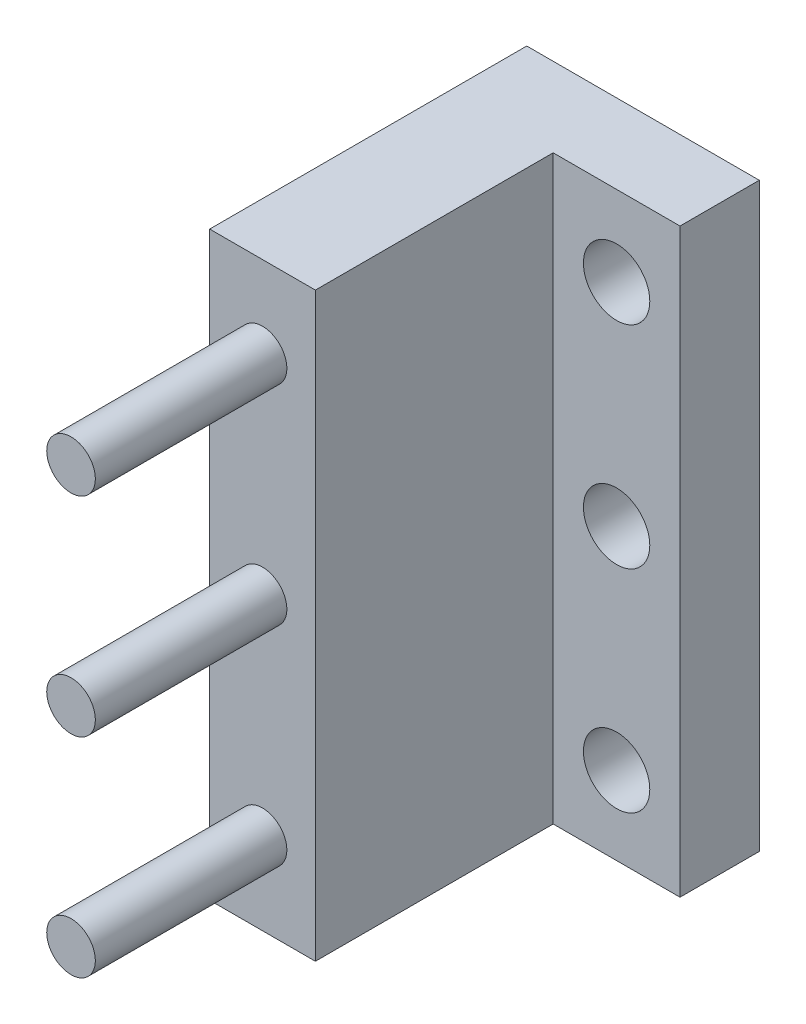
ISO-10303-21;
HEADER;
FILE_DESCRIPTION(('STEP AP214'),'2;1');
FILE_NAME('part.step','',(''),(''),'','','');
FILE_SCHEMA(('AUTOMOTIVE_DESIGN { 1 0 10303 214 1 1 1 1 }'));
ENDSEC;
DATA;
#1=APPLICATION_CONTEXT('core data for automotive mechanical design processes');
#2=APPLICATION_PROTOCOL_DEFINITION('international standard','automotive_design',2000,#1);
#3=PRODUCT_CONTEXT('',#1,'mechanical');
#4=PRODUCT('Part','Part','',(#3));
#5=PRODUCT_RELATED_PRODUCT_CATEGORY('part','',(#4));
#6=PRODUCT_DEFINITION_FORMATION('','',#4);
#7=PRODUCT_DEFINITION_CONTEXT('part definition',#1,'design');
#8=PRODUCT_DEFINITION('design','',#6,#7);
#9=PRODUCT_DEFINITION_SHAPE('','',#8);
#10=(LENGTH_UNIT() NAMED_UNIT(*) SI_UNIT(.MILLI.,.METRE.));
#11=(NAMED_UNIT(*) PLANE_ANGLE_UNIT() SI_UNIT($,.RADIAN.));
#12=(NAMED_UNIT(*) SI_UNIT($,.STERADIAN.) SOLID_ANGLE_UNIT());
#13=UNCERTAINTY_MEASURE_WITH_UNIT(LENGTH_MEASURE(1.E-05),#10,'distance_accuracy_value','');
#14=(GEOMETRIC_REPRESENTATION_CONTEXT(3) GLOBAL_UNCERTAINTY_ASSIGNED_CONTEXT((#13)) GLOBAL_UNIT_ASSIGNED_CONTEXT((#10,
#11,#12)) REPRESENTATION_CONTEXT('',''));
#15=CARTESIAN_POINT('',(0.,0.,0.));
#16=DIRECTION('',(0.,0.,1.));
#17=DIRECTION('',(1.,0.,0.));
#18=AXIS2_PLACEMENT_3D('',#15,#16,#17);
#19=CARTESIAN_POINT('',(-187.959999937843,125.470053269357,30.1625));
#20=DIRECTION('',(1.,0.,0.));
#21=DIRECTION('',(0.,0.,-1.));
#22=AXIS2_PLACEMENT_3D('',#19,#20,#21);
#23=PLANE('',#22);
#24=DIRECTION('',(0.,-1.,0.));
#25=VECTOR('',#24,1.);
#26=CARTESIAN_POINT('',(-187.959999937843,125.470053269357,25.4));
#27=LINE('',#26,#25);
#28=CARTESIAN_POINT('',(-187.959999937843,125.470053269357,25.4));
#29=VERTEX_POINT('',#28);
#30=CARTESIAN_POINT('',(-187.959999937843,90.5450532693566,25.4));
#31=VERTEX_POINT('',#30);
#32=EDGE_CURVE('E93',#29,#31,#27,.T.);
#33=ORIENTED_EDGE('',*,*,#32,.T.);
#34=DIRECTION('',(0.,0.,-1.));
#35=VECTOR('',#34,1.);
#36=CARTESIAN_POINT('',(-187.959999937843,90.5450532693566,30.1625));
#37=LINE('',#36,#35);
#38=CARTESIAN_POINT('',(-187.959999937843,90.5450532693566,44.45));
#39=VERTEX_POINT('',#38);
#40=EDGE_CURVE('E115',#39,#31,#37,.T.);
#41=ORIENTED_EDGE('',*,*,#40,.F.);
#42=DIRECTION('',(0.,-1.,0.));
#43=VECTOR('',#42,1.);
#44=CARTESIAN_POINT('',(-187.959999937843,90.5450532693566,44.45));
#45=LINE('',#44,#43);
#46=CARTESIAN_POINT('',(-187.959999937843,125.470053269357,44.45));
#47=VERTEX_POINT('',#46);
#48=EDGE_CURVE('E95',#47,#39,#45,.T.);
#49=ORIENTED_EDGE('',*,*,#48,.F.);
#50=DIRECTION('',(0.,0.,-1.));
#51=VECTOR('',#50,1.);
#52=CARTESIAN_POINT('',(-187.959999937843,125.470053269357,30.1625));
#53=LINE('',#52,#51);
#54=EDGE_CURVE('E79',#47,#29,#53,.T.);
#55=ORIENTED_EDGE('',*,*,#54,.T.);
#56=EDGE_LOOP('',(#33,#41,#49,#55));
#57=FACE_BOUND('',#56,.T.);
#58=ADVANCED_FACE('F33',(#57),#23,.F.);
#59=CARTESIAN_POINT('',(-187.959999937843,90.5450532693566,30.1625));
#60=DIRECTION('',(0.,1.,0.));
#61=DIRECTION('',(-1.,0.,0.));
#62=AXIS2_PLACEMENT_3D('',#59,#60,#61);
#63=PLANE('',#62);
#64=DIRECTION('',(1.,0.,0.));
#65=VECTOR('',#64,1.);
#66=CARTESIAN_POINT('',(-187.959999937843,90.5450532693566,25.4));
#67=LINE('',#66,#65);
#68=CARTESIAN_POINT('',(-173.989999937843,90.5450532693565,25.4));
#69=VERTEX_POINT('',#68);
#70=EDGE_CURVE('E99',#31,#69,#67,.T.);
#71=ORIENTED_EDGE('',*,*,#70,.T.);
#72=DIRECTION('',(0.,0.,-1.));
#73=VECTOR('',#72,1.);
#74=CARTESIAN_POINT('',(-173.989999937843,90.5450532693565,30.1625));
#75=LINE('',#74,#73);
#76=CARTESIAN_POINT('',(-173.989999937843,90.5450532693565,30.1625));
#77=VERTEX_POINT('',#76);
#78=EDGE_CURVE('E112',#77,#69,#75,.T.);
#79=ORIENTED_EDGE('',*,*,#78,.F.);
#80=DIRECTION('',(1.,0.,0.));
#81=VECTOR('',#80,1.);
#82=CARTESIAN_POINT('',(-187.959999937843,90.5450532693566,30.1625));
#83=LINE('',#82,#81);
#84=CARTESIAN_POINT('',(-181.609999937843,90.5450532693566,30.1625));
#85=VERTEX_POINT('',#84);
#86=EDGE_CURVE('E86',#85,#77,#83,.T.);
#87=ORIENTED_EDGE('',*,*,#86,.F.);
#88=DIRECTION('',(0.,0.,-1.));
#89=VECTOR('',#88,1.);
#90=CARTESIAN_POINT('',(-181.609999937843,90.5450532693566,44.45));
#91=LINE('',#90,#89);
#92=CARTESIAN_POINT('',(-181.609999937843,90.5450532693566,44.45));
#93=VERTEX_POINT('',#92);
#94=EDGE_CURVE('E101',#93,#85,#91,.T.);
#95=ORIENTED_EDGE('',*,*,#94,.F.);
#96=DIRECTION('',(1.,0.,0.));
#97=VECTOR('',#96,1.);
#98=CARTESIAN_POINT('',(-187.959999937843,90.5450532693566,44.45));
#99=LINE('',#98,#97);
#100=EDGE_CURVE('E148',#39,#93,#99,.T.);
#101=ORIENTED_EDGE('',*,*,#100,.F.);
#102=ORIENTED_EDGE('',*,*,#40,.T.);
#103=EDGE_LOOP('',(#71,#79,#87,#95,#101,#102));
#104=FACE_BOUND('',#103,.T.);
#105=ADVANCED_FACE('F177',(#104),#63,.F.);
#106=CARTESIAN_POINT('',(-173.989999937843,125.470053269357,30.1625));
#107=DIRECTION('',(-1.,0.,0.));
#108=DIRECTION('',(0.,-1.,0.));
#109=AXIS2_PLACEMENT_3D('',#106,#107,#108);
#110=PLANE('',#109);
#111=DIRECTION('',(0.,1.,0.));
#112=VECTOR('',#111,1.);
#113=CARTESIAN_POINT('',(-173.989999937843,125.470053269357,25.4));
#114=LINE('',#113,#112);
#115=CARTESIAN_POINT('',(-173.989999937843,125.470053269357,25.4));
#116=VERTEX_POINT('',#115);
#117=EDGE_CURVE('E87',#69,#116,#114,.T.);
#118=ORIENTED_EDGE('',*,*,#117,.T.);
#119=DIRECTION('',(0.,0.,-1.));
#120=VECTOR('',#119,1.);
#121=CARTESIAN_POINT('',(-173.989999937843,125.470053269357,30.1625));
#122=LINE('',#121,#120);
#123=CARTESIAN_POINT('',(-173.989999937843,125.470053269357,30.1625));
#124=VERTEX_POINT('',#123);
#125=EDGE_CURVE('E82',#124,#116,#122,.T.);
#126=ORIENTED_EDGE('',*,*,#125,.F.);
#127=DIRECTION('',(0.,1.,0.));
#128=VECTOR('',#127,1.);
#129=CARTESIAN_POINT('',(-173.989999937843,125.470053269357,30.1625));
#130=LINE('',#129,#128);
#131=EDGE_CURVE('E55',#77,#124,#130,.T.);
#132=ORIENTED_EDGE('',*,*,#131,.F.);
#133=ORIENTED_EDGE('',*,*,#78,.T.);
#134=EDGE_LOOP('',(#118,#126,#132,#133));
#135=FACE_BOUND('',#134,.T.);
#136=ADVANCED_FACE('F180',(#135),#110,.F.);
#137=CARTESIAN_POINT('',(-187.959999937843,125.470053269357,30.1625));
#138=DIRECTION('',(0.,-1.,0.));
#139=DIRECTION('',(1.,0.,0.));
#140=AXIS2_PLACEMENT_3D('',#137,#138,#139);
#141=PLANE('',#140);
#142=DIRECTION('',(-1.,0.,0.));
#143=VECTOR('',#142,1.);
#144=CARTESIAN_POINT('',(-187.959999937843,125.470053269357,25.4));
#145=LINE('',#144,#143);
#146=EDGE_CURVE('E75',#116,#29,#145,.T.);
#147=ORIENTED_EDGE('',*,*,#146,.T.);
#148=ORIENTED_EDGE('',*,*,#54,.F.);
#149=DIRECTION('',(-1.,0.,0.));
#150=VECTOR('',#149,1.);
#151=CARTESIAN_POINT('',(-187.959999937843,125.470053269357,44.45));
#152=LINE('',#151,#150);
#153=CARTESIAN_POINT('',(-181.609999937843,125.470053269357,44.45));
#154=VERTEX_POINT('',#153);
#155=EDGE_CURVE('E154',#154,#47,#152,.T.);
#156=ORIENTED_EDGE('',*,*,#155,.F.);
#157=DIRECTION('',(0.,0.,-1.));
#158=VECTOR('',#157,1.);
#159=CARTESIAN_POINT('',(-181.609999937843,125.470053269357,44.45));
#160=LINE('',#159,#158);
#161=CARTESIAN_POINT('',(-181.609999937843,125.470053269357,30.1625));
#162=VERTEX_POINT('',#161);
#163=EDGE_CURVE('E105',#154,#162,#160,.T.);
#164=ORIENTED_EDGE('',*,*,#163,.T.);
#165=DIRECTION('',(-1.,0.,0.));
#166=VECTOR('',#165,1.);
#167=CARTESIAN_POINT('',(-187.959999937843,125.470053269357,30.1625));
#168=LINE('',#167,#166);
#169=EDGE_CURVE('E96',#124,#162,#168,.T.);
#170=ORIENTED_EDGE('',*,*,#169,.F.);
#171=ORIENTED_EDGE('',*,*,#125,.T.);
#172=EDGE_LOOP('',(#147,#148,#156,#164,#170,#171));
#173=FACE_BOUND('',#172,.T.);
#174=ADVANCED_FACE('F77',(#173),#141,.F.);
#175=CARTESIAN_POINT('',(0.,0.,30.1625));
#176=DIRECTION('',(0.,0.,1.));
#177=DIRECTION('',(1.,0.,0.));
#178=AXIS2_PLACEMENT_3D('',#175,#176,#177);
#179=PLANE('',#178);
#180=CARTESIAN_POINT('',(-177.799999937845,95.2440532693565,30.1625));
#181=DIRECTION('',(0.,0.,1.));
#182=DIRECTION('',(1.,0.,0.));
#183=AXIS2_PLACEMENT_3D('',#180,#181,#182);
#184=CIRCLE('',#183,1.99389999999994);
#185=CARTESIAN_POINT('',(-175.806099937845,95.2440532693565,30.1625));
#186=VERTEX_POINT('',#185);
#187=EDGE_CURVE('E125',#186,#186,#184,.T.);
#188=ORIENTED_EDGE('',*,*,#187,.F.);
#189=EDGE_LOOP('',(#188));
#190=FACE_BOUND('',#189,.T.);
#191=CARTESIAN_POINT('',(-177.799999937845,107.944053269357,30.1625));
#192=DIRECTION('',(0.,0.,1.));
#193=DIRECTION('',(1.,0.,0.));
#194=AXIS2_PLACEMENT_3D('',#191,#192,#193);
#195=CIRCLE('',#194,1.99389999999994);
#196=CARTESIAN_POINT('',(-175.806099937845,107.944053269357,30.1625));
#197=VERTEX_POINT('',#196);
#198=EDGE_CURVE('E333',#197,#197,#195,.T.);
#199=ORIENTED_EDGE('',*,*,#198,.F.);
#200=EDGE_LOOP('',(#199));
#201=FACE_BOUND('',#200,.T.);
#202=CARTESIAN_POINT('',(-177.799999937845,120.644053269357,30.1625));
#203=DIRECTION('',(0.,0.,1.));
#204=DIRECTION('',(1.,0.,0.));
#205=AXIS2_PLACEMENT_3D('',#202,#203,#204);
#206=CIRCLE('',#205,1.99389999999997);
#207=CARTESIAN_POINT('',(-175.806099937845,120.644053269357,30.1625));
#208=VERTEX_POINT('',#207);
#209=EDGE_CURVE('E142',#208,#208,#206,.T.);
#210=ORIENTED_EDGE('',*,*,#209,.F.);
#211=EDGE_LOOP('',(#210));
#212=FACE_BOUND('',#211,.T.);
#213=DIRECTION('',(0.,1.,0.));
#214=VECTOR('',#213,1.);
#215=CARTESIAN_POINT('',(-181.609999937843,90.5450532693566,30.1625));
#216=LINE('',#215,#214);
#217=EDGE_CURVE('E49',#85,#162,#216,.T.);
#218=ORIENTED_EDGE('',*,*,#217,.F.);
#219=ORIENTED_EDGE('',*,*,#86,.T.);
#220=ORIENTED_EDGE('',*,*,#131,.T.);
#221=ORIENTED_EDGE('',*,*,#169,.T.);
#222=EDGE_LOOP('',(#218,#219,#220,#221));
#223=FACE_BOUND('',#222,.T.);
#224=ADVANCED_FACE('F160',(#190,#201,#212,#223),#179,.T.);
#225=CARTESIAN_POINT('',(0.,0.,25.4));
#226=DIRECTION('',(0.,0.,1.));
#227=DIRECTION('',(1.,0.,0.));
#228=AXIS2_PLACEMENT_3D('',#225,#226,#227);
#229=PLANE('',#228);
#230=CARTESIAN_POINT('',(-177.799999937845,95.2440532693565,25.4));
#231=DIRECTION('',(0.,0.,1.));
#232=DIRECTION('',(1.,0.,0.));
#233=AXIS2_PLACEMENT_3D('',#230,#231,#232);
#234=CIRCLE('',#233,1.99389999999994);
#235=CARTESIAN_POINT('',(-175.806099937845,95.2440532693565,25.4));
#236=VERTEX_POINT('',#235);
#237=EDGE_CURVE('E36',#236,#236,#234,.T.);
#238=ORIENTED_EDGE('',*,*,#237,.T.);
#239=EDGE_LOOP('',(#238));
#240=FACE_BOUND('',#239,.T.);
#241=CARTESIAN_POINT('',(-177.799999937845,107.944053269357,25.4));
#242=DIRECTION('',(0.,0.,1.));
#243=DIRECTION('',(1.,0.,0.));
#244=AXIS2_PLACEMENT_3D('',#241,#242,#243);
#245=CIRCLE('',#244,1.99389999999994);
#246=CARTESIAN_POINT('',(-175.806099937845,107.944053269357,25.4));
#247=VERTEX_POINT('',#246);
#248=EDGE_CURVE('E124',#247,#247,#245,.T.);
#249=ORIENTED_EDGE('',*,*,#248,.T.);
#250=EDGE_LOOP('',(#249));
#251=FACE_BOUND('',#250,.T.);
#252=CARTESIAN_POINT('',(-177.799999937845,120.644053269357,25.4));
#253=DIRECTION('',(0.,0.,1.));
#254=DIRECTION('',(1.,0.,0.));
#255=AXIS2_PLACEMENT_3D('',#252,#253,#254);
#256=CIRCLE('',#255,1.99389999999997);
#257=CARTESIAN_POINT('',(-175.806099937845,120.644053269357,25.4));
#258=VERTEX_POINT('',#257);
#259=EDGE_CURVE('E122',#258,#258,#256,.T.);
#260=ORIENTED_EDGE('',*,*,#259,.T.);
#261=EDGE_LOOP('',(#260));
#262=FACE_BOUND('',#261,.T.);
#263=ORIENTED_EDGE('',*,*,#32,.F.);
#264=ORIENTED_EDGE('',*,*,#146,.F.);
#265=ORIENTED_EDGE('',*,*,#117,.F.);
#266=ORIENTED_EDGE('',*,*,#70,.F.);
#267=EDGE_LOOP('',(#263,#264,#265,#266));
#268=FACE_BOUND('',#267,.T.);
#269=ADVANCED_FACE('F98',(#240,#251,#262,#268),#229,.F.);
#270=CARTESIAN_POINT('',(-181.609999937843,90.5450532693566,44.45));
#271=DIRECTION('',(-1.,0.,0.));
#272=DIRECTION('',(0.,0.,1.));
#273=AXIS2_PLACEMENT_3D('',#270,#271,#272);
#274=PLANE('',#273);
#275=ORIENTED_EDGE('',*,*,#217,.T.);
#276=ORIENTED_EDGE('',*,*,#163,.F.);
#277=DIRECTION('',(0.,1.,0.));
#278=VECTOR('',#277,1.);
#279=CARTESIAN_POINT('',(-181.609999937843,90.5450532693566,44.45));
#280=LINE('',#279,#278);
#281=EDGE_CURVE('E151',#93,#154,#280,.T.);
#282=ORIENTED_EDGE('',*,*,#281,.F.);
#283=ORIENTED_EDGE('',*,*,#94,.T.);
#284=EDGE_LOOP('',(#275,#276,#282,#283));
#285=FACE_BOUND('',#284,.T.);
#286=ADVANCED_FACE('F164',(#285),#274,.F.);
#287=CARTESIAN_POINT('',(0.,0.,44.45));
#288=DIRECTION('',(0.,0.,-1.));
#289=DIRECTION('',(-1.,0.,0.));
#290=AXIS2_PLACEMENT_3D('',#287,#288,#289);
#291=PLANE('',#290);
#292=CARTESIAN_POINT('',(-184.784999937843,95.4739740693566,44.45));
#293=DIRECTION('',(0.,0.,-1.));
#294=DIRECTION('',(-1.,0.,0.));
#295=AXIS2_PLACEMENT_3D('',#292,#293,#294);
#296=CIRCLE('',#295,1.4605);
#297=CARTESIAN_POINT('',(-186.245499937843,95.4739740693566,44.45));
#298=VERTEX_POINT('',#297);
#299=EDGE_CURVE('E11',#298,#298,#296,.F.);
#300=ORIENTED_EDGE('',*,*,#299,.F.);
#301=EDGE_LOOP('',(#300));
#302=FACE_BOUND('',#301,.T.);
#303=CARTESIAN_POINT('',(-184.784999937843,108.007553269357,44.45));
#304=DIRECTION('',(0.,0.,-1.));
#305=DIRECTION('',(-1.,0.,0.));
#306=AXIS2_PLACEMENT_3D('',#303,#304,#305);
#307=CIRCLE('',#306,1.4605);
#308=CARTESIAN_POINT('',(-186.245499937843,108.007553269357,44.45));
#309=VERTEX_POINT('',#308);
#310=EDGE_CURVE('E41',#309,#309,#307,.F.);
#311=ORIENTED_EDGE('',*,*,#310,.F.);
#312=EDGE_LOOP('',(#311));
#313=FACE_BOUND('',#312,.T.);
#314=CARTESIAN_POINT('',(-184.784999937843,120.541132469357,44.45));
#315=DIRECTION('',(0.,0.,-1.));
#316=DIRECTION('',(-1.,0.,0.));
#317=AXIS2_PLACEMENT_3D('',#314,#315,#316);
#318=CIRCLE('',#317,1.4605);
#319=CARTESIAN_POINT('',(-186.245499937843,120.541132469357,44.45));
#320=VERTEX_POINT('',#319);
#321=EDGE_CURVE('E117',#320,#320,#318,.F.);
#322=ORIENTED_EDGE('',*,*,#321,.F.);
#323=EDGE_LOOP('',(#322));
#324=FACE_BOUND('',#323,.T.);
#325=ORIENTED_EDGE('',*,*,#48,.T.);
#326=ORIENTED_EDGE('',*,*,#100,.T.);
#327=ORIENTED_EDGE('',*,*,#281,.T.);
#328=ORIENTED_EDGE('',*,*,#155,.T.);
#329=EDGE_LOOP('',(#325,#326,#327,#328));
#330=FACE_BOUND('',#329,.T.);
#331=ADVANCED_FACE('F171',(#302,#313,#324,#330),#291,.F.);
#332=CARTESIAN_POINT('',(-184.784999937843,120.541132469357,55.9562));
#333=DIRECTION('',(0.,0.,-1.));
#334=DIRECTION('',(-1.,0.,0.));
#335=AXIS2_PLACEMENT_3D('',#332,#333,#334);
#336=CYLINDRICAL_SURFACE('',#335,1.4605);
#337=CARTESIAN_POINT('',(-184.784999937843,120.541132469357,55.9562));
#338=DIRECTION('',(0.,0.,1.));
#339=DIRECTION('',(1.,0.,0.));
#340=AXIS2_PLACEMENT_3D('',#337,#338,#339);
#341=CIRCLE('',#340,1.4605);
#342=CARTESIAN_POINT('',(-183.324499937843,120.541132469357,55.9562));
#343=VERTEX_POINT('',#342);
#344=EDGE_CURVE('E139',#343,#343,#341,.T.);
#345=ORIENTED_EDGE('',*,*,#344,.F.);
#346=EDGE_LOOP('',(#345));
#347=FACE_BOUND('',#346,.T.);
#348=ORIENTED_EDGE('',*,*,#321,.T.);
#349=EDGE_LOOP('',(#348));
#350=FACE_BOUND('',#349,.T.);
#351=ADVANCED_FACE('F222',(#347,#350),#336,.T.);
#352=CARTESIAN_POINT('',(-184.784999937843,120.541132469357,55.9562));
#353=DIRECTION('',(0.,0.,1.));
#354=DIRECTION('',(1.,0.,0.));
#355=AXIS2_PLACEMENT_3D('',#352,#353,#354);
#356=PLANE('',#355);
#357=ORIENTED_EDGE('',*,*,#344,.T.);
#358=EDGE_LOOP('',(#357));
#359=FACE_BOUND('',#358,.T.);
#360=ADVANCED_FACE('F232',(#359),#356,.T.);
#361=CARTESIAN_POINT('',(-184.784999937843,108.007553269357,55.9562));
#362=DIRECTION('',(0.,0.,-1.));
#363=DIRECTION('',(-1.,0.,0.));
#364=AXIS2_PLACEMENT_3D('',#361,#362,#363);
#365=CYLINDRICAL_SURFACE('',#364,1.4605);
#366=CARTESIAN_POINT('',(-184.784999937843,108.007553269357,55.9562));
#367=DIRECTION('',(0.,0.,1.));
#368=DIRECTION('',(1.,0.,0.));
#369=AXIS2_PLACEMENT_3D('',#366,#367,#368);
#370=CIRCLE('',#369,1.4605);
#371=CARTESIAN_POINT('',(-183.324499937843,108.007553269357,55.9562));
#372=VERTEX_POINT('',#371);
#373=EDGE_CURVE('E134',#372,#372,#370,.T.);
#374=ORIENTED_EDGE('',*,*,#373,.F.);
#375=EDGE_LOOP('',(#374));
#376=FACE_BOUND('',#375,.T.);
#377=ORIENTED_EDGE('',*,*,#310,.T.);
#378=EDGE_LOOP('',(#377));
#379=FACE_BOUND('',#378,.T.);
#380=ADVANCED_FACE('F242',(#376,#379),#365,.T.);
#381=CARTESIAN_POINT('',(-184.784999937843,108.007553269357,55.9562));
#382=DIRECTION('',(0.,0.,1.));
#383=DIRECTION('',(1.,0.,0.));
#384=AXIS2_PLACEMENT_3D('',#381,#382,#383);
#385=PLANE('',#384);
#386=ORIENTED_EDGE('',*,*,#373,.T.);
#387=EDGE_LOOP('',(#386));
#388=FACE_BOUND('',#387,.T.);
#389=ADVANCED_FACE('F252',(#388),#385,.T.);
#390=CARTESIAN_POINT('',(-184.784999937843,95.4739740693566,55.9562));
#391=DIRECTION('',(0.,0.,-1.));
#392=DIRECTION('',(-1.,0.,0.));
#393=AXIS2_PLACEMENT_3D('',#390,#391,#392);
#394=CYLINDRICAL_SURFACE('',#393,1.4605);
#395=CARTESIAN_POINT('',(-184.784999937843,95.4739740693566,55.9562));
#396=DIRECTION('',(0.,0.,1.));
#397=DIRECTION('',(1.,0.,0.));
#398=AXIS2_PLACEMENT_3D('',#395,#396,#397);
#399=CIRCLE('',#398,1.4605);
#400=CARTESIAN_POINT('',(-183.324499937843,95.4739740693566,55.9562));
#401=VERTEX_POINT('',#400);
#402=EDGE_CURVE('E130',#401,#401,#399,.T.);
#403=ORIENTED_EDGE('',*,*,#402,.F.);
#404=EDGE_LOOP('',(#403));
#405=FACE_BOUND('',#404,.T.);
#406=ORIENTED_EDGE('',*,*,#299,.T.);
#407=EDGE_LOOP('',(#406));
#408=FACE_BOUND('',#407,.T.);
#409=ADVANCED_FACE('F262',(#405,#408),#394,.T.);
#410=CARTESIAN_POINT('',(-184.784999937843,95.4739740693566,55.9562));
#411=DIRECTION('',(0.,0.,1.));
#412=DIRECTION('',(1.,0.,0.));
#413=AXIS2_PLACEMENT_3D('',#410,#411,#412);
#414=PLANE('',#413);
#415=ORIENTED_EDGE('',*,*,#402,.T.);
#416=EDGE_LOOP('',(#415));
#417=FACE_BOUND('',#416,.T.);
#418=ADVANCED_FACE('F272',(#417),#414,.T.);
#419=CARTESIAN_POINT('',(-177.799999937845,120.644053269357,18.6563));
#420=DIRECTION('',(0.,0.,1.));
#421=DIRECTION('',(1.,0.,0.));
#422=AXIS2_PLACEMENT_3D('',#419,#420,#421);
#423=CYLINDRICAL_SURFACE('',#422,1.99389999999997);
#424=ORIENTED_EDGE('',*,*,#209,.T.);
#425=EDGE_LOOP('',(#424));
#426=FACE_BOUND('',#425,.T.);
#427=ORIENTED_EDGE('',*,*,#259,.F.);
#428=EDGE_LOOP('',(#427));
#429=FACE_BOUND('',#428,.T.);
#430=ADVANCED_FACE('F282',(#426,#429),#423,.F.);
#431=CARTESIAN_POINT('',(-177.799999937845,107.944053269357,18.6563));
#432=DIRECTION('',(0.,0.,1.));
#433=DIRECTION('',(1.,0.,0.));
#434=AXIS2_PLACEMENT_3D('',#431,#432,#433);
#435=CYLINDRICAL_SURFACE('',#434,1.99389999999994);
#436=ORIENTED_EDGE('',*,*,#198,.T.);
#437=EDGE_LOOP('',(#436));
#438=FACE_BOUND('',#437,.T.);
#439=ORIENTED_EDGE('',*,*,#248,.F.);
#440=EDGE_LOOP('',(#439));
#441=FACE_BOUND('',#440,.T.);
#442=ADVANCED_FACE('F306',(#438,#441),#435,.F.);
#443=CARTESIAN_POINT('',(-177.799999937845,95.2440532693565,18.6563));
#444=DIRECTION('',(0.,0.,1.));
#445=DIRECTION('',(1.,0.,0.));
#446=AXIS2_PLACEMENT_3D('',#443,#444,#445);
#447=CYLINDRICAL_SURFACE('',#446,1.99389999999994);
#448=ORIENTED_EDGE('',*,*,#187,.T.);
#449=EDGE_LOOP('',(#448));
#450=FACE_BOUND('',#449,.T.);
#451=ORIENTED_EDGE('',*,*,#237,.F.);
#452=EDGE_LOOP('',(#451));
#453=FACE_BOUND('',#452,.T.);
#454=ADVANCED_FACE('F316',(#450,#453),#447,.F.);
#455=CLOSED_SHELL('',(#58,#105,#136,#174,#224,#269,#286,#331,#351,#360,#380,#389,#409,#418,#430,
#442,#454));
#456=MANIFOLD_SOLID_BREP('B2',#455);
#457=ADVANCED_BREP_SHAPE_REPRESENTATION('',(#18,#456),#14);
#458=SHAPE_DEFINITION_REPRESENTATION(#9,#457);
ENDSEC;
END-ISO-10303-21;
